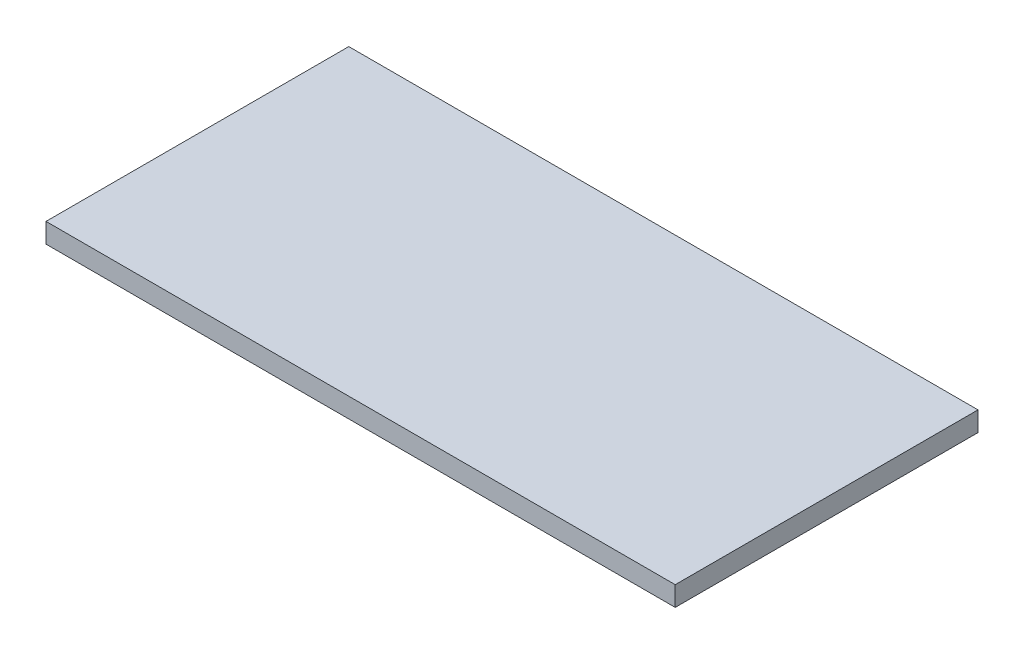
ISO-10303-21;
HEADER;
FILE_DESCRIPTION(('STEP AP214'),'2;1');
FILE_NAME('part.step','',(''),(''),'','','');
FILE_SCHEMA(('AUTOMOTIVE_DESIGN { 1 0 10303 214 1 1 1 1 }'));
ENDSEC;
DATA;
#1=APPLICATION_CONTEXT('core data for automotive mechanical design processes');
#2=APPLICATION_PROTOCOL_DEFINITION('international standard','automotive_design',2000,#1);
#3=PRODUCT_CONTEXT('',#1,'mechanical');
#4=PRODUCT('Part','Part','',(#3));
#5=PRODUCT_RELATED_PRODUCT_CATEGORY('part','',(#4));
#6=PRODUCT_DEFINITION_FORMATION('','',#4);
#7=PRODUCT_DEFINITION_CONTEXT('part definition',#1,'design');
#8=PRODUCT_DEFINITION('design','',#6,#7);
#9=PRODUCT_DEFINITION_SHAPE('','',#8);
#10=(LENGTH_UNIT() NAMED_UNIT(*) SI_UNIT(.MILLI.,.METRE.));
#11=(NAMED_UNIT(*) PLANE_ANGLE_UNIT() SI_UNIT($,.RADIAN.));
#12=(NAMED_UNIT(*) SI_UNIT($,.STERADIAN.) SOLID_ANGLE_UNIT());
#13=UNCERTAINTY_MEASURE_WITH_UNIT(LENGTH_MEASURE(1.E-05),#10,'distance_accuracy_value','');
#14=(GEOMETRIC_REPRESENTATION_CONTEXT(3) GLOBAL_UNCERTAINTY_ASSIGNED_CONTEXT((#13)) GLOBAL_UNIT_ASSIGNED_CONTEXT((#10,
#11,#12)) REPRESENTATION_CONTEXT('',''));
#15=CARTESIAN_POINT('',(0.,0.,0.));
#16=DIRECTION('',(0.,0.,1.));
#17=DIRECTION('',(1.,0.,0.));
#18=AXIS2_PLACEMENT_3D('',#15,#16,#17);
#19=CARTESIAN_POINT('',(0.,6.35,0.));
#20=DIRECTION('',(1.,0.,0.));
#21=DIRECTION('',(0.,0.,-1.));
#22=AXIS2_PLACEMENT_3D('',#19,#20,#21);
#23=PLANE('',#22);
#24=DIRECTION('',(0.,0.,1.));
#25=VECTOR('',#24,1.);
#26=CARTESIAN_POINT('',(0.,0.,0.));
#27=LINE('',#26,#25);
#28=CARTESIAN_POINT('',(0.,0.,-97.536));
#29=VERTEX_POINT('',#28);
#30=CARTESIAN_POINT('',(0.,0.,0.));
#31=VERTEX_POINT('',#30);
#32=EDGE_CURVE('E95',#29,#31,#27,.T.);
#33=ORIENTED_EDGE('',*,*,#32,.T.);
#34=DIRECTION('',(0.,-1.,0.));
#35=VECTOR('',#34,1.);
#36=CARTESIAN_POINT('',(0.,6.35,0.));
#37=LINE('',#36,#35);
#38=CARTESIAN_POINT('',(0.,6.35,0.));
#39=VERTEX_POINT('',#38);
#40=EDGE_CURVE('E11',#39,#31,#37,.T.);
#41=ORIENTED_EDGE('',*,*,#40,.F.);
#42=DIRECTION('',(0.,0.,1.));
#43=VECTOR('',#42,1.);
#44=CARTESIAN_POINT('',(0.,6.35,0.));
#45=LINE('',#44,#43);
#46=CARTESIAN_POINT('',(0.,6.35,-97.536));
#47=VERTEX_POINT('',#46);
#48=EDGE_CURVE('E83',#47,#39,#45,.T.);
#49=ORIENTED_EDGE('',*,*,#48,.F.);
#50=DIRECTION('',(0.,-1.,0.));
#51=VECTOR('',#50,1.);
#52=CARTESIAN_POINT('',(0.,6.35,-97.536));
#53=LINE('',#52,#51);
#54=EDGE_CURVE('E91',#47,#29,#53,.T.);
#55=ORIENTED_EDGE('',*,*,#54,.T.);
#56=EDGE_LOOP('',(#33,#41,#49,#55));
#57=FACE_BOUND('',#56,.T.);
#58=ADVANCED_FACE('F32',(#57),#23,.F.);
#59=CARTESIAN_POINT('',(0.,6.35,0.));
#60=DIRECTION('',(0.,0.,-1.));
#61=DIRECTION('',(-1.,0.,0.));
#62=AXIS2_PLACEMENT_3D('',#59,#60,#61);
#63=PLANE('',#62);
#64=DIRECTION('',(1.,0.,0.));
#65=VECTOR('',#64,1.);
#66=CARTESIAN_POINT('',(0.,0.,0.));
#67=LINE('',#66,#65);
#68=CARTESIAN_POINT('',(202.692,0.,0.));
#69=VERTEX_POINT('',#68);
#70=EDGE_CURVE('E87',#31,#69,#67,.T.);
#71=ORIENTED_EDGE('',*,*,#70,.T.);
#72=DIRECTION('',(0.,-1.,0.));
#73=VECTOR('',#72,1.);
#74=CARTESIAN_POINT('',(202.692,6.35,0.));
#75=LINE('',#74,#73);
#76=CARTESIAN_POINT('',(202.692,6.35,0.));
#77=VERTEX_POINT('',#76);
#78=EDGE_CURVE('E40',#77,#69,#75,.T.);
#79=ORIENTED_EDGE('',*,*,#78,.F.);
#80=DIRECTION('',(1.,0.,0.));
#81=VECTOR('',#80,1.);
#82=CARTESIAN_POINT('',(0.,6.35,0.));
#83=LINE('',#82,#81);
#84=EDGE_CURVE('E78',#39,#77,#83,.T.);
#85=ORIENTED_EDGE('',*,*,#84,.F.);
#86=ORIENTED_EDGE('',*,*,#40,.T.);
#87=EDGE_LOOP('',(#71,#79,#85,#86));
#88=FACE_BOUND('',#87,.T.);
#89=ADVANCED_FACE('F86',(#88),#63,.F.);
#90=CARTESIAN_POINT('',(202.692,6.35,0.));
#91=DIRECTION('',(-1.,0.,0.));
#92=DIRECTION('',(0.,0.,1.));
#93=AXIS2_PLACEMENT_3D('',#90,#91,#92);
#94=PLANE('',#93);
#95=DIRECTION('',(0.,0.,-1.));
#96=VECTOR('',#95,1.);
#97=CARTESIAN_POINT('',(202.692,0.,0.));
#98=LINE('',#97,#96);
#99=CARTESIAN_POINT('',(202.692,0.,-97.536));
#100=VERTEX_POINT('',#99);
#101=EDGE_CURVE('E65',#69,#100,#98,.T.);
#102=ORIENTED_EDGE('',*,*,#101,.T.);
#103=DIRECTION('',(0.,-1.,0.));
#104=VECTOR('',#103,1.);
#105=CARTESIAN_POINT('',(202.692,6.35,-97.536));
#106=LINE('',#105,#104);
#107=CARTESIAN_POINT('',(202.692,6.35,-97.536));
#108=VERTEX_POINT('',#107);
#109=EDGE_CURVE('E88',#108,#100,#106,.T.);
#110=ORIENTED_EDGE('',*,*,#109,.F.);
#111=DIRECTION('',(0.,0.,-1.));
#112=VECTOR('',#111,1.);
#113=CARTESIAN_POINT('',(202.692,6.35,0.));
#114=LINE('',#113,#112);
#115=EDGE_CURVE('E81',#77,#108,#114,.T.);
#116=ORIENTED_EDGE('',*,*,#115,.F.);
#117=ORIENTED_EDGE('',*,*,#78,.T.);
#118=EDGE_LOOP('',(#102,#110,#116,#117));
#119=FACE_BOUND('',#118,.T.);
#120=ADVANCED_FACE('F89',(#119),#94,.F.);
#121=CARTESIAN_POINT('',(0.,6.35,-97.536));
#122=DIRECTION('',(0.,0.,1.));
#123=DIRECTION('',(1.,0.,0.));
#124=AXIS2_PLACEMENT_3D('',#121,#122,#123);
#125=PLANE('',#124);
#126=DIRECTION('',(-1.,0.,0.));
#127=VECTOR('',#126,1.);
#128=CARTESIAN_POINT('',(0.,0.,-97.536));
#129=LINE('',#128,#127);
#130=EDGE_CURVE('E71',#100,#29,#129,.T.);
#131=ORIENTED_EDGE('',*,*,#130,.T.);
#132=ORIENTED_EDGE('',*,*,#54,.F.);
#133=DIRECTION('',(-1.,0.,0.));
#134=VECTOR('',#133,1.);
#135=CARTESIAN_POINT('',(0.,6.35,-97.536));
#136=LINE('',#135,#134);
#137=EDGE_CURVE('E48',#108,#47,#136,.T.);
#138=ORIENTED_EDGE('',*,*,#137,.F.);
#139=ORIENTED_EDGE('',*,*,#109,.T.);
#140=EDGE_LOOP('',(#131,#132,#138,#139));
#141=FACE_BOUND('',#140,.T.);
#142=ADVANCED_FACE('F102',(#141),#125,.F.);
#143=CARTESIAN_POINT('',(0.,6.35,0.));
#144=DIRECTION('',(0.,-1.,0.));
#145=DIRECTION('',(0.,0.,-1.));
#146=AXIS2_PLACEMENT_3D('',#143,#144,#145);
#147=PLANE('',#146);
#148=ORIENTED_EDGE('',*,*,#48,.T.);
#149=ORIENTED_EDGE('',*,*,#84,.T.);
#150=ORIENTED_EDGE('',*,*,#115,.T.);
#151=ORIENTED_EDGE('',*,*,#137,.T.);
#152=EDGE_LOOP('',(#148,#149,#150,#151));
#153=FACE_BOUND('',#152,.T.);
#154=ADVANCED_FACE('F79',(#153),#147,.F.);
#155=CARTESIAN_POINT('',(0.,0.,0.));
#156=DIRECTION('',(0.,-1.,0.));
#157=DIRECTION('',(0.,0.,-1.));
#158=AXIS2_PLACEMENT_3D('',#155,#156,#157);
#159=PLANE('',#158);
#160=ORIENTED_EDGE('',*,*,#32,.F.);
#161=ORIENTED_EDGE('',*,*,#130,.F.);
#162=ORIENTED_EDGE('',*,*,#101,.F.);
#163=ORIENTED_EDGE('',*,*,#70,.F.);
#164=EDGE_LOOP('',(#160,#161,#162,#163));
#165=FACE_BOUND('',#164,.T.);
#166=ADVANCED_FACE('F105',(#165),#159,.T.);
#167=CLOSED_SHELL('',(#58,#89,#120,#142,#154,#166));
#168=MANIFOLD_SOLID_BREP('B2',#167);
#169=ADVANCED_BREP_SHAPE_REPRESENTATION('',(#18,#168),#14);
#170=SHAPE_DEFINITION_REPRESENTATION(#9,#169);
ENDSEC;
END-ISO-10303-21;
